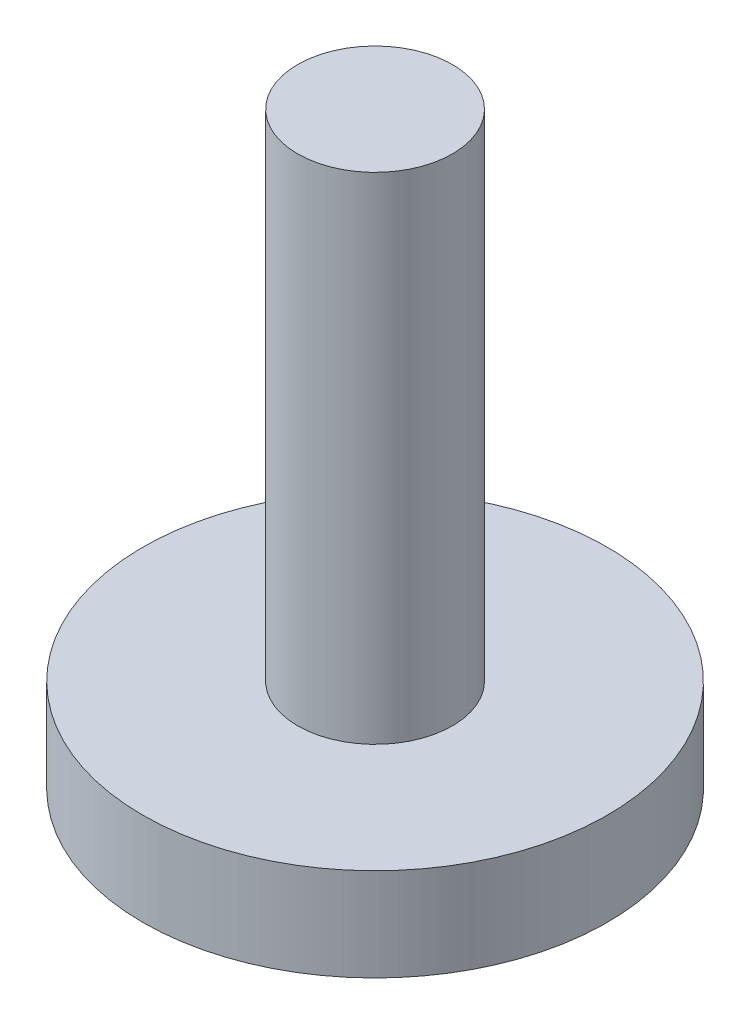
ISO-10303-21;
HEADER;
FILE_DESCRIPTION(('STEP AP214'),'2;1');
FILE_NAME('part.step','',(''),(''),'','','');
FILE_SCHEMA(('AUTOMOTIVE_DESIGN { 1 0 10303 214 1 1 1 1 }'));
ENDSEC;
DATA;
#1=APPLICATION_CONTEXT('core data for automotive mechanical design processes');
#2=APPLICATION_PROTOCOL_DEFINITION('international standard','automotive_design',2000,#1);
#3=PRODUCT_CONTEXT('',#1,'mechanical');
#4=PRODUCT('Part','Part','',(#3));
#5=PRODUCT_RELATED_PRODUCT_CATEGORY('part','',(#4));
#6=PRODUCT_DEFINITION_FORMATION('','',#4);
#7=PRODUCT_DEFINITION_CONTEXT('part definition',#1,'design');
#8=PRODUCT_DEFINITION('design','',#6,#7);
#9=PRODUCT_DEFINITION_SHAPE('','',#8);
#10=(LENGTH_UNIT() NAMED_UNIT(*) SI_UNIT(.MILLI.,.METRE.));
#11=(NAMED_UNIT(*) PLANE_ANGLE_UNIT() SI_UNIT($,.RADIAN.));
#12=(NAMED_UNIT(*) SI_UNIT($,.STERADIAN.) SOLID_ANGLE_UNIT());
#13=UNCERTAINTY_MEASURE_WITH_UNIT(LENGTH_MEASURE(1.E-05),#10,'distance_accuracy_value','');
#14=(GEOMETRIC_REPRESENTATION_CONTEXT(3) GLOBAL_UNCERTAINTY_ASSIGNED_CONTEXT((#13)) GLOBAL_UNIT_ASSIGNED_CONTEXT((#10,
#11,#12)) REPRESENTATION_CONTEXT('',''));
#15=CARTESIAN_POINT('',(0.,0.,0.));
#16=DIRECTION('',(0.,0.,1.));
#17=DIRECTION('',(1.,0.,0.));
#18=AXIS2_PLACEMENT_3D('',#15,#16,#17);
#19=CARTESIAN_POINT('',(0.,3.,0.));
#20=DIRECTION('',(0.,1.,0.));
#21=DIRECTION('',(0.,0.,1.));
#22=AXIS2_PLACEMENT_3D('',#19,#20,#21);
#23=PLANE('',#22);
#24=CARTESIAN_POINT('',(0.,3.,0.));
#25=DIRECTION('',(0.,1.,0.));
#26=DIRECTION('',(0.,0.,1.));
#27=AXIS2_PLACEMENT_3D('',#24,#25,#26);
#28=CIRCLE('',#27,7.5);
#29=CARTESIAN_POINT('',(0.,3.,7.5));
#30=VERTEX_POINT('',#29);
#31=EDGE_CURVE('E10',#30,#30,#28,.T.);
#32=ORIENTED_EDGE('',*,*,#31,.T.);
#33=EDGE_LOOP('',(#32));
#34=FACE_BOUND('',#33,.T.);
#35=CARTESIAN_POINT('',(0.,3.,0.));
#36=DIRECTION('',(0.,1.,0.));
#37=DIRECTION('',(0.,0.,1.));
#38=AXIS2_PLACEMENT_3D('',#35,#36,#37);
#39=CIRCLE('',#38,2.5);
#40=CARTESIAN_POINT('',(0.,3.,2.5));
#41=VERTEX_POINT('',#40);
#42=EDGE_CURVE('E44',#41,#41,#39,.T.);
#43=ORIENTED_EDGE('',*,*,#42,.F.);
#44=EDGE_LOOP('',(#43));
#45=FACE_BOUND('',#44,.T.);
#46=ADVANCED_FACE('F31',(#34,#45),#23,.T.);
#47=CARTESIAN_POINT('',(0.,3.,0.));
#48=DIRECTION('',(0.,-1.,0.));
#49=DIRECTION('',(0.,0.,-1.));
#50=AXIS2_PLACEMENT_3D('',#47,#48,#49);
#51=CYLINDRICAL_SURFACE('',#50,7.5);
#52=ORIENTED_EDGE('',*,*,#31,.F.);
#53=EDGE_LOOP('',(#52));
#54=FACE_BOUND('',#53,.T.);
#55=CARTESIAN_POINT('',(0.,0.,0.));
#56=DIRECTION('',(0.,1.,0.));
#57=DIRECTION('',(0.,0.,1.));
#58=AXIS2_PLACEMENT_3D('',#55,#56,#57);
#59=CIRCLE('',#58,7.5);
#60=CARTESIAN_POINT('',(0.,0.,7.5));
#61=VERTEX_POINT('',#60);
#62=EDGE_CURVE('E35',#61,#61,#59,.T.);
#63=ORIENTED_EDGE('',*,*,#62,.T.);
#64=EDGE_LOOP('',(#63));
#65=FACE_BOUND('',#64,.T.);
#66=ADVANCED_FACE('F33',(#54,#65),#51,.T.);
#67=CARTESIAN_POINT('',(0.,0.,0.));
#68=DIRECTION('',(0.,1.,0.));
#69=DIRECTION('',(0.,0.,1.));
#70=AXIS2_PLACEMENT_3D('',#67,#68,#69);
#71=PLANE('',#70);
#72=ORIENTED_EDGE('',*,*,#62,.F.);
#73=EDGE_LOOP('',(#72));
#74=FACE_BOUND('',#73,.T.);
#75=ADVANCED_FACE('F55',(#74),#71,.F.);
#76=CARTESIAN_POINT('',(0.,19.,0.));
#77=DIRECTION('',(0.,-1.,0.));
#78=DIRECTION('',(0.,0.,-1.));
#79=AXIS2_PLACEMENT_3D('',#76,#77,#78);
#80=CYLINDRICAL_SURFACE('',#79,2.5);
#81=CARTESIAN_POINT('',(0.,19.,0.));
#82=DIRECTION('',(0.,1.,0.));
#83=DIRECTION('',(0.,0.,1.));
#84=AXIS2_PLACEMENT_3D('',#81,#82,#83);
#85=CIRCLE('',#84,2.5);
#86=CARTESIAN_POINT('',(0.,19.,2.5));
#87=VERTEX_POINT('',#86);
#88=EDGE_CURVE('E42',#87,#87,#85,.T.);
#89=ORIENTED_EDGE('',*,*,#88,.F.);
#90=EDGE_LOOP('',(#89));
#91=FACE_BOUND('',#90,.T.);
#92=ORIENTED_EDGE('',*,*,#42,.T.);
#93=EDGE_LOOP('',(#92));
#94=FACE_BOUND('',#93,.T.);
#95=ADVANCED_FACE('F52',(#91,#94),#80,.T.);
#96=CARTESIAN_POINT('',(0.,19.,0.));
#97=DIRECTION('',(0.,1.,0.));
#98=DIRECTION('',(0.,0.,1.));
#99=AXIS2_PLACEMENT_3D('',#96,#97,#98);
#100=PLANE('',#99);
#101=ORIENTED_EDGE('',*,*,#88,.T.);
#102=EDGE_LOOP('',(#101));
#103=FACE_BOUND('',#102,.T.);
#104=ADVANCED_FACE('F50',(#103),#100,.T.);
#105=CLOSED_SHELL('',(#46,#66,#75,#95,#104));
#106=MANIFOLD_SOLID_BREP('B2',#105);
#107=ADVANCED_BREP_SHAPE_REPRESENTATION('',(#18,#106),#14);
#108=SHAPE_DEFINITION_REPRESENTATION(#9,#107);
ENDSEC;
END-ISO-10303-21;
